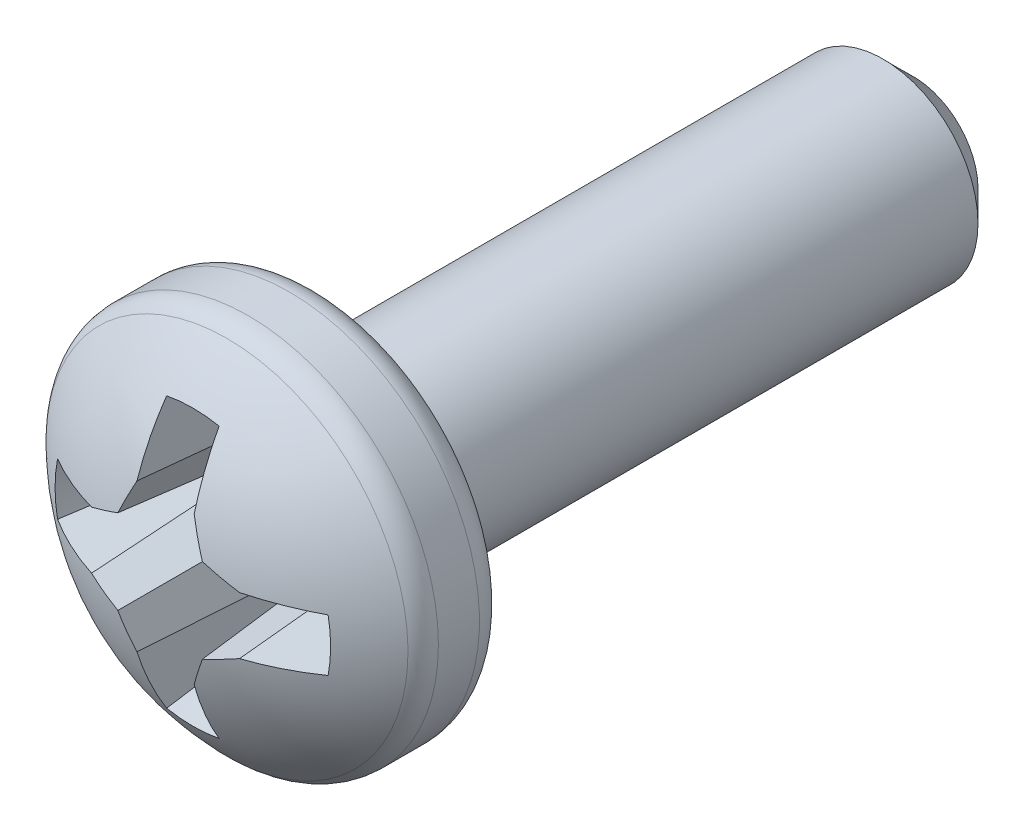
ISO-10303-21;
HEADER;
FILE_DESCRIPTION(('STEP AP214'),'2;1');
FILE_NAME('part.step','',(''),(''),'','','');
FILE_SCHEMA(('AUTOMOTIVE_DESIGN { 1 0 10303 214 1 1 1 1 }'));
ENDSEC;
DATA;
#1=APPLICATION_CONTEXT('core data for automotive mechanical design processes');
#2=APPLICATION_PROTOCOL_DEFINITION('international standard','automotive_design',2000,#1);
#3=PRODUCT_CONTEXT('',#1,'mechanical');
#4=PRODUCT('Part','Part','',(#3));
#5=PRODUCT_RELATED_PRODUCT_CATEGORY('part','',(#4));
#6=PRODUCT_DEFINITION_FORMATION('','',#4);
#7=PRODUCT_DEFINITION_CONTEXT('part definition',#1,'design');
#8=PRODUCT_DEFINITION('design','',#6,#7);
#9=PRODUCT_DEFINITION_SHAPE('','',#8);
#10=(LENGTH_UNIT() NAMED_UNIT(*) SI_UNIT(.MILLI.,.METRE.));
#11=(NAMED_UNIT(*) PLANE_ANGLE_UNIT() SI_UNIT($,.RADIAN.));
#12=(NAMED_UNIT(*) SI_UNIT($,.STERADIAN.) SOLID_ANGLE_UNIT());
#13=UNCERTAINTY_MEASURE_WITH_UNIT(LENGTH_MEASURE(1.E-05),#10,'distance_accuracy_value','');
#14=(GEOMETRIC_REPRESENTATION_CONTEXT(3) GLOBAL_UNCERTAINTY_ASSIGNED_CONTEXT((#13)) GLOBAL_UNIT_ASSIGNED_CONTEXT((#10,
#11,#12)) REPRESENTATION_CONTEXT('',''));
#15=CARTESIAN_POINT('',(0.,0.,0.));
#16=DIRECTION('',(0.,0.,1.));
#17=DIRECTION('',(1.,0.,0.));
#18=AXIS2_PLACEMENT_3D('',#15,#16,#17);
#19=CARTESIAN_POINT('',(-0.962921674615797,0.791461441644268,0.413196607862429));
#20=DIRECTION('',(0.,0.,1.));
#21=DIRECTION('',(1.,0.,0.));
#22=AXIS2_PLACEMENT_3D('',#19,#20,#21);
#23=PLANE('',#22);
#24=DIRECTION('',(0.382683432365081,-0.92387953251129,0.));
#25=VECTOR('',#24,1.);
#26=CARTESIAN_POINT('',(-0.949607787845929,0.796976234112247,0.413196607862429));
#27=LINE('',#26,#25);
#28=CARTESIAN_POINT('',(-0.957178033261302,0.815252423264536,0.413196607862429));
#29=VERTEX_POINT('',#28);
#30=CARTESIAN_POINT('',(-0.951892089679838,0.802491026580226,0.413196607862429));
#31=VERTEX_POINT('',#30);
#32=EDGE_CURVE('E292',#29,#31,#27,.T.);
#33=ORIENTED_EDGE('',*,*,#32,.F.);
#34=DIRECTION('',(0.,1.,0.));
#35=VECTOR('',#34,1.);
#36=CARTESIAN_POINT('',(-0.957178033261302,0.791461441644268,0.413196607862429));
#37=LINE('',#36,#35);
#38=CARTESIAN_POINT('',(-0.957178033261302,0.827667770288032,0.413196607862429));
#39=VERTEX_POINT('',#38);
#40=EDGE_CURVE('E168',#39,#29,#37,.F.);
#41=ORIENTED_EDGE('',*,*,#40,.F.);
#42=CARTESIAN_POINT('',(-0.962921674615797,0.791461441644268,0.413196607862429));
#43=DIRECTION('',(0.,0.,1.));
#44=DIRECTION('',(1.,0.,0.));
#45=AXIS2_PLACEMENT_3D('',#42,#43,#44);
#46=CIRCLE('',#45,0.0366590732270921);
#47=CARTESIAN_POINT('',(-0.968665315970288,0.827667770288033,0.413196607862429));
#48=VERTEX_POINT('',#47);
#49=EDGE_CURVE('E159',#39,#48,#46,.T.);
#50=ORIENTED_EDGE('',*,*,#49,.T.);
#51=DIRECTION('',(0.,1.,0.));
#52=VECTOR('',#51,1.);
#53=CARTESIAN_POINT('',(-0.968665315970287,0.791461441644271,0.413196607862429));
#54=LINE('',#53,#52);
#55=CARTESIAN_POINT('',(-0.968665315970288,0.815252423264539,0.413196607862429));
#56=VERTEX_POINT('',#55);
#57=EDGE_CURVE('E166',#56,#48,#54,.T.);
#58=ORIENTED_EDGE('',*,*,#57,.F.);
#59=DIRECTION('',(0.382683432365079,0.923879532511291,0.));
#60=VECTOR('',#59,1.);
#61=CARTESIAN_POINT('',(-0.976235561385661,0.79697623411225,0.413196607862429));
#62=LINE('',#61,#60);
#63=CARTESIAN_POINT('',(-0.973951259551752,0.802491026580229,0.413196607862429));
#64=VERTEX_POINT('',#63);
#65=EDGE_CURVE('E301',#64,#56,#62,.T.);
#66=ORIENTED_EDGE('',*,*,#65,.F.);
#67=DIRECTION('',(0.923879532511289,0.382683432365086,0.));
#68=VECTOR('',#67,1.);
#69=CARTESIAN_POINT('',(-0.968436467083772,0.804775328414139,0.413196607862429));
#70=LINE('',#69,#68);
#71=CARTESIAN_POINT('',(-0.986712656236062,0.797205082998765,0.413196607862429));
#72=VERTEX_POINT('',#71);
#73=EDGE_CURVE('E307',#72,#64,#70,.T.);
#74=ORIENTED_EDGE('',*,*,#73,.F.);
#75=DIRECTION('',(1.,0.,0.));
#76=VECTOR('',#75,1.);
#77=CARTESIAN_POINT('',(-0.962921674615793,0.797205082998765,0.413196607862429));
#78=LINE('',#77,#76);
#79=CARTESIAN_POINT('',(-0.999128003323473,0.797205082997996,0.413196607853642));
#80=VERTEX_POINT('',#79);
#81=EDGE_CURVE('E313',#80,#72,#78,.T.);
#82=ORIENTED_EDGE('',*,*,#81,.F.);
#83=CARTESIAN_POINT('',(-0.962921674615794,0.791461441644271,0.413196607862429));
#84=DIRECTION('',(0.,0.,1.));
#85=DIRECTION('',(1.,0.,0.));
#86=AXIS2_PLACEMENT_3D('',#83,#84,#85);
#87=CIRCLE('',#86,0.0366590732924525);
#88=CARTESIAN_POINT('',(-0.999128003325736,0.78571780028978,0.413196607862429));
#89=VERTEX_POINT('',#88);
#90=EDGE_CURVE('E410',#80,#89,#87,.T.);
#91=ORIENTED_EDGE('',*,*,#90,.T.);
#92=DIRECTION('',(1.,0.,0.));
#93=VECTOR('',#92,1.);
#94=CARTESIAN_POINT('',(-0.962921674615797,0.78571780028978,0.413196607862429));
#95=LINE('',#94,#93);
#96=CARTESIAN_POINT('',(-0.986712656236065,0.78571780028978,0.413196607862429));
#97=VERTEX_POINT('',#96);
#98=EDGE_CURVE('E247',#97,#89,#95,.F.);
#99=ORIENTED_EDGE('',*,*,#98,.F.);
#100=DIRECTION('',(-0.923879532511292,0.382683432365076,0.));
#101=VECTOR('',#100,1.);
#102=CARTESIAN_POINT('',(-0.968436467083776,0.778147554874406,0.413196607862429));
#103=LINE('',#102,#101);
#104=CARTESIAN_POINT('',(-0.973951259551755,0.780431856708316,0.413196607862429));
#105=VERTEX_POINT('',#104);
#106=EDGE_CURVE('E248',#105,#97,#103,.T.);
#107=ORIENTED_EDGE('',*,*,#106,.F.);
#108=DIRECTION('',(-0.38268343236509,0.923879532511287,0.));
#109=VECTOR('',#108,1.);
#110=CARTESIAN_POINT('',(-0.976235561385665,0.785946649176296,0.413196607862429));
#111=LINE('',#110,#109);
#112=CARTESIAN_POINT('',(-0.96866531597029,0.767670460024005,0.413196607862429));
#113=VERTEX_POINT('',#112);
#114=EDGE_CURVE('E254',#113,#105,#111,.T.);
#115=ORIENTED_EDGE('',*,*,#114,.F.);
#116=DIRECTION('',(0.,1.,0.));
#117=VECTOR('',#116,1.);
#118=CARTESIAN_POINT('',(-0.968665315970291,0.791461441644275,0.413196607862429));
#119=LINE('',#118,#117);
#120=CARTESIAN_POINT('',(-0.96866531597029,0.755255113000512,0.413196607862429));
#121=VERTEX_POINT('',#120);
#122=EDGE_CURVE('E260',#121,#113,#119,.T.);
#123=ORIENTED_EDGE('',*,*,#122,.F.);
#124=CARTESIAN_POINT('',(-0.962921674615796,0.791461441644275,0.413196607862429));
#125=DIRECTION('',(0.,0.,1.));
#126=DIRECTION('',(1.,0.,0.));
#127=AXIS2_PLACEMENT_3D('',#124,#125,#126);
#128=CIRCLE('',#127,0.0366590732270904);
#129=CARTESIAN_POINT('',(-0.957178033261305,0.755255113000512,0.413196607862429));
#130=VERTEX_POINT('',#129);
#131=EDGE_CURVE('E336',#121,#130,#128,.T.);
#132=ORIENTED_EDGE('',*,*,#131,.T.);
#133=DIRECTION('',(0.,1.,0.));
#134=VECTOR('',#133,1.);
#135=CARTESIAN_POINT('',(-0.957178033261306,0.791461441644272,0.413196607862429));
#136=LINE('',#135,#134);
#137=CARTESIAN_POINT('',(-0.957178033261305,0.767670460024002,0.413196607862429));
#138=VERTEX_POINT('',#137);
#139=EDGE_CURVE('E266',#138,#130,#136,.F.);
#140=ORIENTED_EDGE('',*,*,#139,.F.);
#141=DIRECTION('',(-0.382683432365075,-0.923879532511293,0.));
#142=VECTOR('',#141,1.);
#143=CARTESIAN_POINT('',(-0.949607787845931,0.785946649176293,0.413196607862429));
#144=LINE('',#143,#142);
#145=CARTESIAN_POINT('',(-0.951892089679841,0.780431856708313,0.413196607862429));
#146=VERTEX_POINT('',#145);
#147=EDGE_CURVE('E267',#146,#138,#144,.T.);
#148=ORIENTED_EDGE('',*,*,#147,.F.);
#149=DIRECTION('',(-0.923879532511286,-0.382683432365092,0.));
#150=VECTOR('',#149,1.);
#151=CARTESIAN_POINT('',(-0.957406882147821,0.778147554874402,0.413196607862429));
#152=LINE('',#151,#150);
#153=CARTESIAN_POINT('',(-0.939130692995531,0.785717800289777,0.413196607862429));
#154=VERTEX_POINT('',#153);
#155=EDGE_CURVE('E273',#154,#146,#152,.T.);
#156=ORIENTED_EDGE('',*,*,#155,.F.);
#157=DIRECTION('',(1.,0.,0.));
#158=VECTOR('',#157,1.);
#159=CARTESIAN_POINT('',(-0.9629216746158,0.785717800289777,0.413196607862429));
#160=LINE('',#159,#158);
#161=CARTESIAN_POINT('',(-0.926715345972033,0.785717800289777,0.413196607862429));
#162=VERTEX_POINT('',#161);
#163=EDGE_CURVE('E279',#162,#154,#160,.F.);
#164=ORIENTED_EDGE('',*,*,#163,.F.);
#165=CARTESIAN_POINT('',(-0.962921674615797,0.791461441644268,0.413196607862429));
#166=DIRECTION('',(0.,0.,1.));
#167=DIRECTION('',(1.,0.,0.));
#168=AXIS2_PLACEMENT_3D('',#165,#166,#167);
#169=CIRCLE('',#168,0.0366590732270921);
#170=CARTESIAN_POINT('',(-0.926715345972033,0.797205082998762,0.413196607862429));
#171=VERTEX_POINT('',#170);
#172=EDGE_CURVE('E492',#162,#171,#169,.T.);
#173=ORIENTED_EDGE('',*,*,#172,.T.);
#174=DIRECTION('',(1.,0.,0.));
#175=VECTOR('',#174,1.);
#176=CARTESIAN_POINT('',(-0.962921674615797,0.797205082998762,0.413196607862429));
#177=LINE('',#176,#175);
#178=CARTESIAN_POINT('',(-0.939130692995528,0.797205082998762,0.413196607862429));
#179=VERTEX_POINT('',#178);
#180=EDGE_CURVE('E285',#179,#171,#177,.T.);
#181=ORIENTED_EDGE('',*,*,#180,.F.);
#182=DIRECTION('',(0.92387953251129,-0.382683432365083,0.));
#183=VECTOR('',#182,1.);
#184=CARTESIAN_POINT('',(-0.957406882147817,0.804775328414136,0.413196607862429));
#185=LINE('',#184,#183);
#186=EDGE_CURVE('E286',#31,#179,#185,.T.);
#187=ORIENTED_EDGE('',*,*,#186,.F.);
#188=EDGE_LOOP('',(#33,#41,#50,#58,#66,#74,#82,#91,#99,#107,#115,#123,#132,#140,#148,#156,#164,
#173,#181,#187));
#189=FACE_BOUND('',#188,.T.);
#190=ADVANCED_FACE('F17',(#189),#23,.T.);
#191=CARTESIAN_POINT('',(-0.962921674615793,0.801303961329311,0.460047001563216));
#192=DIRECTION('',(0.,-0.996194698091744,0.0871557427476727));
#193=DIRECTION('',(0.,-0.0871557427476727,-0.996194698091744));
#194=AXIS2_PLACEMENT_3D('',#191,#192,#193);
#195=PLANE('',#194);
#196=DIRECTION('',(0.0173337504938421,-0.0871426484044557,-0.996045029063884));
#197=VECTOR('',#196,1.);
#198=CARTESIAN_POINT('',(-0.987456056740421,0.8009424097128,0.455914447676356));
#199=LINE('',#198,#197);
#200=CARTESIAN_POINT('',(-0.987456056740421,0.8009424097128,0.455914447676356));
#201=VERTEX_POINT('',#200);
#202=EDGE_CURVE('E310',#201,#72,#199,.T.);
#203=ORIENTED_EDGE('',*,*,#202,.F.);
#204=CARTESIAN_POINT('',(-1.0077693076876,0.800151088875881,0.446869609122098));
#205=CARTESIAN_POINT('',(-1.00458094800443,0.800321424804083,0.448816557690383));
#206=CARTESIAN_POINT('',(-1.00129399725059,0.800472536171256,0.450543768520713));
#207=CARTESIAN_POINT('',(-0.994522913601554,0.800736309783544,0.453558714705462));
#208=CARTESIAN_POINT('',(-0.991038780706358,0.800848972028658,0.45484645005988));
#209=CARTESIAN_POINT('',(-0.987456056740485,0.800942409712743,0.455914447676344));
#210=B_SPLINE_CURVE_WITH_KNOTS('',3,(#204,#205,#206,#207,#208,#209),.UNSPECIFIED.,.F.,.F.,(4,2,
4),(0.,0.011148597867128,0.022297195734256),.UNSPECIFIED.);
#211=CARTESIAN_POINT('',(-1.00776930767702,0.800151088874494,0.446869609106245));
#212=VERTEX_POINT('',#211);
#213=EDGE_CURVE('E409',#212,#201,#210,.T.);
#214=ORIENTED_EDGE('',*,*,#213,.F.);
#215=CARTESIAN_POINT('',(-1.00776930766644,0.800151088873107,0.446869609090392));
#216=CARTESIAN_POINT('',(-1.00633283988868,0.79966000435443,0.441256487356838));
#217=CARTESIAN_POINT('',(-1.00489449731313,0.799168961608414,0.435643843086986));
#218=CARTESIAN_POINT('',(-1.00201406253148,0.798186959649785,0.424419509338453));
#219=CARTESIAN_POINT('',(-1.00057197032529,0.797696000437175,0.418807819859794));
#220=CARTESIAN_POINT('',(-0.999128003321212,0.797205082997228,0.41319660784486));
#221=B_SPLINE_CURVE_WITH_KNOTS('',3,(#215,#216,#217,#218,#219,#220),.UNSPECIFIED.,.F.,.F.,(4,2,
4),(0.,0.0174443558891331,0.0348887122017165),.UNSPECIFIED.);
#222=EDGE_CURVE('E318',#212,#80,#221,.T.);
#223=ORIENTED_EDGE('',*,*,#222,.T.);
#224=ORIENTED_EDGE('',*,*,#81,.T.);
#225=EDGE_LOOP('',(#203,#214,#223,#224));
#226=FACE_BOUND('',#225,.T.);
#227=ADVANCED_FACE('F427',(#226),#195,.T.);
#228=CARTESIAN_POINT('',(-0.970005039912152,0.808562198209984,0.460047001563216));
#229=DIRECTION('',(0.381227206369649,-0.920363891963225,0.0871557427476661));
#230=DIRECTION('',(0.923879532511289,0.382683432365086,0.));
#231=AXIS2_PLACEMENT_3D('',#228,#229,#230);
#232=PLANE('',#231);
#233=DIRECTION('',(0.0666626913468222,-0.0666626913468392,-0.995546167269401));
#234=VECTOR('',#233,1.);
#235=CARTESIAN_POINT('',(-0.976933038303313,0.805472805331791,0.457726739301586));
#236=LINE('',#235,#234);
#237=CARTESIAN_POINT('',(-0.976933038303313,0.805472805331791,0.457726739301586));
#238=VERTEX_POINT('',#237);
#239=EDGE_CURVE('E304',#238,#64,#236,.T.);
#240=ORIENTED_EDGE('',*,*,#239,.F.);
#241=CARTESIAN_POINT('',(-0.987456056740421,0.8009424097128,0.455914447676356));
#242=CARTESIAN_POINT('',(-0.985725687185486,0.801700049456703,0.456346321822599));
#243=CARTESIAN_POINT('',(-0.983983584204926,0.802456402296903,0.456713283197823));
#244=CARTESIAN_POINT('',(-0.980475911392557,0.8039665341699,0.457317380406233));
#245=CARTESIAN_POINT('',(-0.978710341560748,0.804720313202697,0.457554516239419));
#246=CARTESIAN_POINT('',(-0.976933038303313,0.805472805331791,0.457726739301586));
#247=B_SPLINE_CURVE_WITH_KNOTS('',3,(#241,#242,#243,#244,#245,#246),.UNSPECIFIED.,.F.,.F.,(4,2,
4),(0.,0.00580300590917728,0.0116060118183544),.UNSPECIFIED.);
#248=EDGE_CURVE('E439',#201,#238,#247,.T.);
#249=ORIENTED_EDGE('',*,*,#248,.F.);
#250=ORIENTED_EDGE('',*,*,#202,.T.);
#251=ORIENTED_EDGE('',*,*,#73,.T.);
#252=EDGE_LOOP('',(#240,#249,#250,#251));
#253=FACE_BOUND('',#252,.T.);
#254=ADVANCED_FACE('F431',(#253),#232,.T.);
#255=CARTESIAN_POINT('',(-0.980022431181506,0.79854480694063,0.460047001563216));
#256=DIRECTION('',(0.920363891963229,-0.381227206369643,0.0871557427476506));
#257=DIRECTION('',(0.382683432365079,0.923879532511291,0.));
#258=AXIS2_PLACEMENT_3D('',#255,#256,#257);
#259=PLANE('',#258);
#260=DIRECTION('',(0.0871426484044276,-0.0173337504938855,-0.996045029063886));
#261=VECTOR('',#260,1.);
#262=CARTESIAN_POINT('',(-0.972402642684322,0.8159958237689,0.455914447676355));
#263=LINE('',#262,#261);
#264=CARTESIAN_POINT('',(-0.972402642684322,0.8159958237689,0.455914447676355));
#265=VERTEX_POINT('',#264);
#266=EDGE_CURVE('E176',#265,#56,#263,.T.);
#267=ORIENTED_EDGE('',*,*,#266,.F.);
#268=CARTESIAN_POINT('',(-0.976933038303313,0.805472805331791,0.457726739301586));
#269=CARTESIAN_POINT('',(-0.976180546174218,0.807250108589226,0.457554516239419));
#270=CARTESIAN_POINT('',(-0.975426767141422,0.809015678421036,0.457317380406232));
#271=CARTESIAN_POINT('',(-0.973916635268425,0.812523351233405,0.456713283197822));
#272=CARTESIAN_POINT('',(-0.973160282428224,0.814265454213965,0.456346321822598));
#273=CARTESIAN_POINT('',(-0.972402642684322,0.8159958237689,0.455914447676355));
#274=B_SPLINE_CURVE_WITH_KNOTS('',3,(#268,#269,#270,#271,#272,#273),.UNSPECIFIED.,.F.,.F.,(4,2,
4),(0.,0.00580300590917786,0.0116060118183556),.UNSPECIFIED.);
#275=EDGE_CURVE('E445',#238,#265,#274,.T.);
#276=ORIENTED_EDGE('',*,*,#275,.F.);
#277=ORIENTED_EDGE('',*,*,#239,.T.);
#278=ORIENTED_EDGE('',*,*,#65,.T.);
#279=EDGE_LOOP('',(#267,#276,#277,#278));
#280=FACE_BOUND('',#279,.T.);
#281=ADVANCED_FACE('F436',(#280),#259,.T.);
#282=CARTESIAN_POINT('',(-0.972764194300832,0.791461441644271,0.460047001563216));
#283=DIRECTION('',(0.996194698091747,0.,0.0871557427476441));
#284=DIRECTION('',(0.0871557427476441,0.,-0.996194698091747));
#285=AXIS2_PLACEMENT_3D('',#282,#283,#284);
#286=PLANE('',#285);
#287=CARTESIAN_POINT('',(-0.968665315976766,0.827667770297469,0.413196607882989));
#288=CARTESIAN_POINT('',(-0.969156233414293,0.829111737306517,0.41880781989701));
#289=CARTESIAN_POINT('',(-0.969647192625244,0.83055382951834,0.424419509374523));
#290=CARTESIAN_POINT('',(-0.970629194582071,0.833434264312577,0.435643843120299));
#291=CARTESIAN_POINT('',(-0.971120237327945,0.834872606895081,0.44125648738854));
#292=CARTESIAN_POINT('',(-0.971611321847241,0.836309074680451,0.446869609120248));
#293=B_SPLINE_CURVE_WITH_KNOTS('',3,(#287,#288,#289,#290,#291,#292),.UNSPECIFIED.,.F.,.F.,(4,2,
4),(0.,0.0174443563130369,0.0348887122026249),.UNSPECIFIED.);
#294=CARTESIAN_POINT('',(-0.971611321846646,0.836309074678713,0.446869609113457));
#295=VERTEX_POINT('',#294);
#296=EDGE_CURVE('E170',#48,#295,#293,.T.);
#297=ORIENTED_EDGE('',*,*,#296,.T.);
#298=CARTESIAN_POINT('',(-0.972402642684322,0.8159958237689,0.455914447676355));
#299=CARTESIAN_POINT('',(-0.97230920500029,0.819578547731674,0.454846450060827));
#300=CARTESIAN_POINT('',(-0.97219654275527,0.823062680623964,0.453558714707706));
#301=CARTESIAN_POINT('',(-0.971932769143257,0.829833764267578,0.450543768526282));
#302=CARTESIAN_POINT('',(-0.971781657776262,0.833120715018901,0.448816557697978));
#303=CARTESIAN_POINT('',(-0.971611321848281,0.83630907469974,0.446869609132083));
#304=B_SPLINE_CURVE_WITH_KNOTS('',3,(#298,#299,#300,#301,#302,#303),.UNSPECIFIED.,.F.,.F.,(4,2,
4),(0.,0.0111485978575969,0.0222971957151939),.UNSPECIFIED.);
#305=EDGE_CURVE('E450',#265,#295,#304,.T.);
#306=ORIENTED_EDGE('',*,*,#305,.F.);
#307=ORIENTED_EDGE('',*,*,#266,.T.);
#308=ORIENTED_EDGE('',*,*,#57,.T.);
#309=EDGE_LOOP('',(#297,#306,#307,#308));
#310=FACE_BOUND('',#309,.T.);
#311=ADVANCED_FACE('F173',(#310),#286,.T.);
#312=CARTESIAN_POINT('',(-0.962921674615797,0.791461441644268,0.446869608992984));
#313=DIRECTION('',(0.,0.,1.));
#314=DIRECTION('',(1.,0.,0.));
#315=AXIS2_PLACEMENT_3D('',#312,#313,#314);
#316=CONICAL_SURFACE('',#315,0.0456817267059768,0.261799388331704);
#317=ORIENTED_EDGE('',*,*,#296,.F.);
#318=ORIENTED_EDGE('',*,*,#49,.F.);
#319=CARTESIAN_POINT('',(-0.954232027377315,0.83630907468785,0.446869609127832));
#320=CARTESIAN_POINT('',(-0.954723111899205,0.834872606899889,0.441256487393958));
#321=CARTESIAN_POINT('',(-0.955214154647399,0.833434264314992,0.435643843123478));
#322=CARTESIAN_POINT('',(-0.956196156608315,0.830553829516367,0.424419509373073));
#323=CARTESIAN_POINT('',(-0.956687115821034,0.829111737302548,0.418807819893171));
#324=CARTESIAN_POINT('',(-0.957178033260055,0.827667770291702,0.413196607876686));
#325=B_SPLINE_CURVE_WITH_KNOTS('',3,(#319,#320,#321,#322,#323,#324),.UNSPECIFIED.,.F.,.F.,(4,2,
4),(0.,0.017444355898436,0.0348887122203239),.UNSPECIFIED.);
#326=CARTESIAN_POINT('',(-0.954232027383437,0.836309074691625,0.446869609130668));
#327=VERTEX_POINT('',#326);
#328=EDGE_CURVE('E182',#327,#39,#325,.T.);
#329=ORIENTED_EDGE('',*,*,#328,.F.);
#330=CARTESIAN_POINT('',(-0.962921674615797,0.791461441644268,0.44686960910667));
#331=DIRECTION('',(0.,0.,1.));
#332=DIRECTION('',(1.,0.,0.));
#333=AXIS2_PLACEMENT_3D('',#330,#331,#332);
#334=CIRCLE('',#333,0.045681726736439);
#335=EDGE_CURVE('E180',#295,#327,#334,.F.);
#336=ORIENTED_EDGE('',*,*,#335,.F.);
#337=EDGE_LOOP('',(#317,#318,#329,#336));
#338=FACE_BOUND('',#337,.T.);
#339=ADVANCED_FACE('F178',(#338),#316,.F.);
#340=CARTESIAN_POINT('',(-0.953079154930757,0.791461441644268,0.460047001563216));
#341=DIRECTION('',(-0.996194698091746,0.,0.0871557427476584));
#342=DIRECTION('',(0.0871557427476584,0.,0.996194698091746));
#343=AXIS2_PLACEMENT_3D('',#340,#341,#342);
#344=PLANE('',#343);
#345=DIRECTION('',(-0.0871426484044405,-0.0173337504938649,-0.996045029063885));
#346=VECTOR('',#345,1.);
#347=CARTESIAN_POINT('',(-0.953440706547268,0.815995823768896,0.455914447676356));
#348=LINE('',#347,#346);
#349=CARTESIAN_POINT('',(-0.953440706547268,0.815995823768896,0.455914447676356));
#350=VERTEX_POINT('',#349);
#351=EDGE_CURVE('E295',#350,#29,#348,.T.);
#352=ORIENTED_EDGE('',*,*,#351,.F.);
#353=CARTESIAN_POINT('',(-0.954232027383349,0.836309074700393,0.446869609131684));
#354=CARTESIAN_POINT('',(-0.954061691455357,0.833120715019461,0.448816557697674));
#355=CARTESIAN_POINT('',(-0.953910580088354,0.829833764268039,0.450543768526058));
#356=CARTESIAN_POINT('',(-0.953646806476326,0.823062680624212,0.453558714707614));
#357=CARTESIAN_POINT('',(-0.9535341442313,0.819578547731807,0.454846450060785));
#358=CARTESIAN_POINT('',(-0.953440706547262,0.81599582376891,0.45591444767635));
#359=B_SPLINE_CURVE_WITH_KNOTS('',3,(#353,#354,#355,#356,#357,#358),.UNSPECIFIED.,.F.,.F.,(4,2,
4),(0.,0.0111485978579733,0.0222971957159465),.UNSPECIFIED.);
#360=EDGE_CURVE('E210',#327,#350,#359,.T.);
#361=ORIENTED_EDGE('',*,*,#360,.F.);
#362=ORIENTED_EDGE('',*,*,#328,.T.);
#363=ORIENTED_EDGE('',*,*,#40,.T.);
#364=EDGE_LOOP('',(#352,#361,#362,#363));
#365=FACE_BOUND('',#364,.T.);
#366=ADVANCED_FACE('F199',(#365),#344,.T.);
#367=CARTESIAN_POINT('',(-0.945820918050084,0.798544806940627,0.460047001563216));
#368=DIRECTION('',(-0.920363891963228,-0.381227206369645,0.0871557427476584));
#369=DIRECTION('',(0.382683432365081,-0.92387953251129,0.));
#370=AXIS2_PLACEMENT_3D('',#367,#368,#369);
#371=PLANE('',#370);
#372=DIRECTION('',(-0.0666626913468367,-0.0666626913468319,-0.995546167269401));
#373=VECTOR('',#372,1.);
#374=CARTESIAN_POINT('',(-0.948910310928276,0.805472805331788,0.457726739301586));
#375=LINE('',#374,#373);
#376=CARTESIAN_POINT('',(-0.948910310928276,0.805472805331788,0.457726739301586));
#377=VERTEX_POINT('',#376);
#378=EDGE_CURVE('E289',#377,#31,#375,.T.);
#379=ORIENTED_EDGE('',*,*,#378,.F.);
#380=CARTESIAN_POINT('',(-0.953440706547268,0.815995823768896,0.455914447676356));
#381=CARTESIAN_POINT('',(-0.952683066803365,0.814265454213961,0.456346321822599));
#382=CARTESIAN_POINT('',(-0.951926713963165,0.812523351233401,0.456713283197823));
#383=CARTESIAN_POINT('',(-0.950416582090168,0.809015678421032,0.457317380406233));
#384=CARTESIAN_POINT('',(-0.949662803057371,0.807250108589222,0.457554516239419));
#385=CARTESIAN_POINT('',(-0.948910310928277,0.805472805331788,0.457726739301586));
#386=B_SPLINE_CURVE_WITH_KNOTS('',3,(#380,#381,#382,#383,#384,#385),.UNSPECIFIED.,.F.,.F.,(4,2,
4),(0.,0.00580300590917724,0.0116060118183544),.UNSPECIFIED.);
#387=EDGE_CURVE('E218',#350,#377,#386,.T.);
#388=ORIENTED_EDGE('',*,*,#387,.F.);
#389=ORIENTED_EDGE('',*,*,#351,.T.);
#390=ORIENTED_EDGE('',*,*,#32,.T.);
#391=EDGE_LOOP('',(#379,#388,#389,#390));
#392=FACE_BOUND('',#391,.T.);
#393=ADVANCED_FACE('F204',(#392),#371,.T.);
#394=CARTESIAN_POINT('',(-0.955838309319437,0.808562198209981,0.460047001563216));
#395=DIRECTION('',(-0.381227206369647,-0.920363891963227,0.0871557427476583));
#396=DIRECTION('',(0.92387953251129,-0.382683432365083,0.));
#397=AXIS2_PLACEMENT_3D('',#394,#395,#396);
#398=PLANE('',#397);
#399=DIRECTION('',(-0.0173337504938598,-0.0871426484044405,-0.996045029063885));
#400=VECTOR('',#399,1.);
#401=CARTESIAN_POINT('',(-0.938387292491168,0.800942409712797,0.455914447676356));
#402=LINE('',#401,#400);
#403=CARTESIAN_POINT('',(-0.938387292491168,0.800942409712797,0.455914447676356));
#404=VERTEX_POINT('',#403);
#405=EDGE_CURVE('E282',#404,#179,#402,.T.);
#406=ORIENTED_EDGE('',*,*,#405,.F.);
#407=CARTESIAN_POINT('',(-0.948910310928276,0.805472805331788,0.457726739301586));
#408=CARTESIAN_POINT('',(-0.947133007670842,0.804720313202693,0.457554516239419));
#409=CARTESIAN_POINT('',(-0.945367437839032,0.803966534169897,0.457317380406232));
#410=CARTESIAN_POINT('',(-0.941859765026662,0.8024564022969,0.456713283197822));
#411=CARTESIAN_POINT('',(-0.940117662046103,0.8017000494567,0.456346321822598));
#412=CARTESIAN_POINT('',(-0.938387292491168,0.800942409712797,0.455914447676355));
#413=B_SPLINE_CURVE_WITH_KNOTS('',3,(#407,#408,#409,#410,#411,#412),.UNSPECIFIED.,.F.,.F.,(4,2,
4),(0.,0.00580300590917751,0.0116060118183548),.UNSPECIFIED.);
#414=EDGE_CURVE('E462',#377,#404,#413,.T.);
#415=ORIENTED_EDGE('',*,*,#414,.F.);
#416=ORIENTED_EDGE('',*,*,#378,.T.);
#417=ORIENTED_EDGE('',*,*,#186,.T.);
#418=EDGE_LOOP('',(#406,#415,#416,#417));
#419=FACE_BOUND('',#418,.T.);
#420=ADVANCED_FACE('F474',(#419),#398,.T.);
#421=CARTESIAN_POINT('',(-0.962921674615797,0.801303961329307,0.460047001563216));
#422=DIRECTION('',(0.,-0.996194698091746,0.0871557427476584));
#423=DIRECTION('',(0.,-0.0871557427476584,-0.996194698091746));
#424=AXIS2_PLACEMENT_3D('',#421,#422,#423);
#425=PLANE('',#424);
#426=CARTESIAN_POINT('',(-0.926715345966802,0.79720508300054,0.41319660788275));
#427=CARTESIAN_POINT('',(-0.925271378955789,0.79769600044037,0.418807819896354));
#428=CARTESIAN_POINT('',(-0.923829286742633,0.798186959652864,0.424419509373678));
#429=CARTESIAN_POINT('',(-0.920948851946995,0.799168961611258,0.435643843119533));
#430=CARTESIAN_POINT('',(-0.919510509364422,0.799660004357156,0.441256487388042));
#431=CARTESIAN_POINT('',(-0.918074041579615,0.800151088875715,0.446869609120248));
#432=B_SPLINE_CURVE_WITH_KNOTS('',3,(#426,#427,#428,#429,#430,#431),.UNSPECIFIED.,.F.,.F.,(4,2,
4),(0.,0.0174443563138727,0.0348887122042951),.UNSPECIFIED.);
#433=CARTESIAN_POINT('',(-0.918074041581353,0.800151088875121,0.446869609113457));
#434=VERTEX_POINT('',#433);
#435=EDGE_CURVE('E351',#171,#434,#432,.T.);
#436=ORIENTED_EDGE('',*,*,#435,.T.);
#437=CARTESIAN_POINT('',(-0.938387292491168,0.800942409712797,0.455914447676355));
#438=CARTESIAN_POINT('',(-0.934804568528381,0.800848972028783,0.454846450060821));
#439=CARTESIAN_POINT('',(-0.931320435636079,0.800736309783763,0.453558714707696));
#440=CARTESIAN_POINT('',(-0.924549351992442,0.80047253617171,0.450543768526262));
#441=CARTESIAN_POINT('',(-0.921262401241108,0.800321424804677,0.448816557697955));
#442=CARTESIAN_POINT('',(-0.918074041560258,0.800151088876637,0.446869609132056));
#443=B_SPLINE_CURVE_WITH_KNOTS('',3,(#437,#438,#439,#440,#441,#442),.UNSPECIFIED.,.F.,.F.,(4,2,
4),(0.,0.0111485978576364,0.0222971957152729),.UNSPECIFIED.);
#444=EDGE_CURVE('E463',#404,#434,#443,.T.);
#445=ORIENTED_EDGE('',*,*,#444,.F.);
#446=ORIENTED_EDGE('',*,*,#405,.T.);
#447=ORIENTED_EDGE('',*,*,#180,.T.);
#448=EDGE_LOOP('',(#436,#445,#446,#447));
#449=FACE_BOUND('',#448,.T.);
#450=ADVANCED_FACE('F477',(#449),#425,.T.);
#451=CARTESIAN_POINT('',(-0.962921674615797,0.791461441644268,0.446869608992984));
#452=DIRECTION('',(0.,0.,1.));
#453=DIRECTION('',(1.,0.,0.));
#454=AXIS2_PLACEMENT_3D('',#451,#452,#453);
#455=CONICAL_SURFACE('',#454,0.0456817267059768,0.261799388331704);
#456=ORIENTED_EDGE('',*,*,#172,.F.);
#457=CARTESIAN_POINT('',(-0.918074041572215,0.78277179440579,0.446869609127831));
#458=CARTESIAN_POINT('',(-0.919510509360244,0.783262878927704,0.44125648739369));
#459=CARTESIAN_POINT('',(-0.92094885194521,0.783753921675921,0.435643843122941));
#460=CARTESIAN_POINT('',(-0.923829286743973,0.784735923636883,0.424419509372));
#461=CARTESIAN_POINT('',(-0.925271378957862,0.785226882849626,0.41880781989183));
#462=CARTESIAN_POINT('',(-0.926715345968777,0.785717800288671,0.413196607875076));
#463=B_SPLINE_CURVE_WITH_KNOTS('',3,(#457,#458,#459,#460,#461,#462),.UNSPECIFIED.,.F.,.F.,(4,2,
4),(0.,0.0174443558992698,0.0348887122219916),.UNSPECIFIED.);
#464=CARTESIAN_POINT('',(-0.918074041568439,0.782771794411913,0.446869609130668));
#465=VERTEX_POINT('',#464);
#466=EDGE_CURVE('E346',#465,#162,#463,.T.);
#467=ORIENTED_EDGE('',*,*,#466,.F.);
#468=CARTESIAN_POINT('',(-0.962921674615797,0.791461441644268,0.44686960910667));
#469=DIRECTION('',(0.,0.,1.));
#470=DIRECTION('',(1.,0.,0.));
#471=AXIS2_PLACEMENT_3D('',#468,#469,#470);
#472=CIRCLE('',#471,0.045681726736439);
#473=EDGE_CURVE('E464',#434,#465,#472,.F.);
#474=ORIENTED_EDGE('',*,*,#473,.F.);
#475=ORIENTED_EDGE('',*,*,#435,.F.);
#476=EDGE_LOOP('',(#456,#467,#474,#475));
#477=FACE_BOUND('',#476,.T.);
#478=ADVANCED_FACE('F482',(#477),#455,.F.);
#479=CARTESIAN_POINT('',(-0.9629216746158,0.781618921959232,0.460047001563216));
#480=DIRECTION('',(0.,0.996194698091747,0.0871557427476441));
#481=DIRECTION('',(0.,-0.0871557427476441,0.996194698091747));
#482=AXIS2_PLACEMENT_3D('',#479,#480,#481);
#483=PLANE('',#482);
#484=DIRECTION('',(-0.0173337504938417,0.0871426484044261,-0.996045029063887));
#485=VECTOR('',#484,1.);
#486=CARTESIAN_POINT('',(-0.938387292491172,0.781980473575742,0.455914447676357));
#487=LINE('',#486,#485);
#488=CARTESIAN_POINT('',(-0.938387292491172,0.781980473575742,0.455914447676357));
#489=VERTEX_POINT('',#488);
#490=EDGE_CURVE('E276',#489,#154,#487,.T.);
#491=ORIENTED_EDGE('',*,*,#490,.F.);
#492=CARTESIAN_POINT('',(-0.918074041559671,0.782771794411824,0.446869609131684));
#493=CARTESIAN_POINT('',(-0.921262401240596,0.782601458483823,0.448816557697669));
#494=CARTESIAN_POINT('',(-0.924549351992011,0.78245034711682,0.45054376852605));
#495=CARTESIAN_POINT('',(-0.931320435635823,0.782186573504812,0.453558714707603));
#496=CARTESIAN_POINT('',(-0.93480456852822,0.782073911259807,0.454846450060776));
#497=CARTESIAN_POINT('',(-0.938387292491108,0.7819804735758,0.455914447676344));
#498=B_SPLINE_CURVE_WITH_KNOTS('',3,(#492,#493,#494,#495,#496,#497),.UNSPECIFIED.,.F.,.F.,(4,2,
4),(0.,0.0111485978579499,0.0222971957159),.UNSPECIFIED.);
#499=EDGE_CURVE('E509',#465,#489,#498,.T.);
#500=ORIENTED_EDGE('',*,*,#499,.F.);
#501=ORIENTED_EDGE('',*,*,#466,.T.);
#502=ORIENTED_EDGE('',*,*,#163,.T.);
#503=EDGE_LOOP('',(#491,#500,#501,#502));
#504=FACE_BOUND('',#503,.T.);
#505=ADVANCED_FACE('F499',(#504),#483,.T.);
#506=CARTESIAN_POINT('',(-0.955838309319441,0.774360685078558,0.460047001563216));
#507=DIRECTION('',(-0.381227206369656,0.920363891963225,0.0871557427476397));
#508=DIRECTION('',(-0.923879532511286,-0.382683432365092,0.));
#509=AXIS2_PLACEMENT_3D('',#506,#507,#508);
#510=PLANE('',#509);
#511=DIRECTION('',(-0.066662691346817,0.0666626913468194,-0.995546167269403));
#512=VECTOR('',#511,1.);
#513=CARTESIAN_POINT('',(-0.94891031092828,0.777450077956752,0.457726739301588));
#514=LINE('',#513,#512);
#515=CARTESIAN_POINT('',(-0.94891031092828,0.777450077956752,0.457726739301588));
#516=VERTEX_POINT('',#515);
#517=EDGE_CURVE('E270',#516,#146,#514,.T.);
#518=ORIENTED_EDGE('',*,*,#517,.F.);
#519=CARTESIAN_POINT('',(-0.938387292491172,0.781980473575742,0.455914447676357));
#520=CARTESIAN_POINT('',(-0.940117662046106,0.781222833831839,0.4563463218226));
#521=CARTESIAN_POINT('',(-0.941859765026666,0.780466480991639,0.456713283197824));
#522=CARTESIAN_POINT('',(-0.945367437839035,0.778956349118642,0.457317380406234));
#523=CARTESIAN_POINT('',(-0.947133007670845,0.778202570085846,0.45755451623942));
#524=CARTESIAN_POINT('',(-0.94891031092828,0.777450077956751,0.457726739301587));
#525=B_SPLINE_CURVE_WITH_KNOTS('',3,(#519,#520,#521,#522,#523,#524),.UNSPECIFIED.,.F.,.F.,(4,2,
4),(0.,0.0058030059091771,0.0116060118183543),.UNSPECIFIED.);
#526=EDGE_CURVE('E515',#489,#516,#525,.T.);
#527=ORIENTED_EDGE('',*,*,#526,.F.);
#528=ORIENTED_EDGE('',*,*,#490,.T.);
#529=ORIENTED_EDGE('',*,*,#155,.T.);
#530=EDGE_LOOP('',(#518,#527,#528,#529));
#531=FACE_BOUND('',#530,.T.);
#532=ADVANCED_FACE('F503',(#531),#510,.T.);
#533=CARTESIAN_POINT('',(-0.945820918050087,0.784378076347913,0.460047001563216));
#534=DIRECTION('',(-0.920363891963232,0.381227206369639,0.0871557427476397));
#535=DIRECTION('',(-0.382683432365075,-0.923879532511293,0.));
#536=AXIS2_PLACEMENT_3D('',#533,#534,#535);
#537=PLANE('',#536);
#538=DIRECTION('',(-0.0871426484044261,0.0173337504938367,-0.996045029063887));
#539=VECTOR('',#538,1.);
#540=CARTESIAN_POINT('',(-0.953440706547271,0.766927059519643,0.455914447676357));
#541=LINE('',#540,#539);
#542=CARTESIAN_POINT('',(-0.953440706547271,0.766927059519643,0.455914447676357));
#543=VERTEX_POINT('',#542);
#544=EDGE_CURVE('E263',#543,#138,#541,.T.);
#545=ORIENTED_EDGE('',*,*,#544,.F.);
#546=CARTESIAN_POINT('',(-0.94891031092828,0.777450077956752,0.457726739301587));
#547=CARTESIAN_POINT('',(-0.949662803057374,0.775672774699317,0.45755451623942));
#548=CARTESIAN_POINT('',(-0.950416582090171,0.773907204867507,0.457317380406234));
#549=CARTESIAN_POINT('',(-0.951926713963168,0.770399532055138,0.456713283197824));
#550=CARTESIAN_POINT('',(-0.952683066803368,0.768657429074578,0.4563463218226));
#551=CARTESIAN_POINT('',(-0.953440706547271,0.766927059519643,0.455914447676357));
#552=B_SPLINE_CURVE_WITH_KNOTS('',3,(#546,#547,#548,#549,#550,#551),.UNSPECIFIED.,.F.,.F.,(4,2,
4),(0.,0.00580300590917769,0.0116060118183553),.UNSPECIFIED.);
#553=EDGE_CURVE('E535',#516,#543,#552,.T.);
#554=ORIENTED_EDGE('',*,*,#553,.F.);
#555=ORIENTED_EDGE('',*,*,#517,.T.);
#556=ORIENTED_EDGE('',*,*,#147,.T.);
#557=EDGE_LOOP('',(#545,#554,#555,#556));
#558=FACE_BOUND('',#557,.T.);
#559=ADVANCED_FACE('F548',(#558),#537,.T.);
#560=CARTESIAN_POINT('',(-0.953079154930761,0.791461441644272,0.460047001563216));
#561=DIRECTION('',(-0.996194698091747,0.,0.0871557427476441));
#562=DIRECTION('',(0.0871557427476441,0.,0.996194698091747));
#563=AXIS2_PLACEMENT_3D('',#560,#561,#562);
#564=PLANE('',#563);
#565=CARTESIAN_POINT('',(-0.957178033254827,0.755255112991075,0.413196607882989));
#566=CARTESIAN_POINT('',(-0.956687115817305,0.7538111459817,0.418807819896942));
#567=CARTESIAN_POINT('',(-0.956196156606361,0.752369053769549,0.424419509374387));
#568=CARTESIAN_POINT('',(-0.955214154649546,0.749488618974655,0.435643843120026));
#569=CARTESIAN_POINT('',(-0.954723111903678,0.748050276391821,0.441256487388198));
#570=CARTESIAN_POINT('',(-0.954232027384388,0.746613808606119,0.446869609119838));
#571=B_SPLINE_CURVE_WITH_KNOTS('',3,(#565,#566,#567,#568,#569,#570),.UNSPECIFIED.,.F.,.F.,(4,2,
4),(0.,0.0174443563130817,0.0348887122027145),.UNSPECIFIED.);
#572=CARTESIAN_POINT('',(-0.954232027384964,0.746613808607805,0.446869609113252));
#573=VERTEX_POINT('',#572);
#574=EDGE_CURVE('E559',#130,#573,#571,.T.);
#575=ORIENTED_EDGE('',*,*,#574,.T.);
#576=CARTESIAN_POINT('',(-0.953440706547271,0.766927059519643,0.455914447676357));
#577=CARTESIAN_POINT('',(-0.953534144231306,0.763344335556773,0.4548464500608));
#578=CARTESIAN_POINT('',(-0.953646806476329,0.759860202664392,0.45355871470764));
#579=CARTESIAN_POINT('',(-0.953910580088351,0.75308911902061,0.450543768526114));
#580=CARTESIAN_POINT('',(-0.954061691455351,0.749802168269209,0.448816557697747));
#581=CARTESIAN_POINT('',(-0.954232027383339,0.746613808588297,0.446869609131778));
#582=B_SPLINE_CURVE_WITH_KNOTS('',3,(#576,#577,#578,#579,#580,#581),.UNSPECIFIED.,.F.,.F.,(4,2,
4),(0.,0.0111485978578924,0.0222971957157848),.UNSPECIFIED.);
#583=EDGE_CURVE('E536',#543,#573,#582,.T.);
#584=ORIENTED_EDGE('',*,*,#583,.F.);
#585=ORIENTED_EDGE('',*,*,#544,.T.);
#586=ORIENTED_EDGE('',*,*,#139,.T.);
#587=EDGE_LOOP('',(#575,#584,#585,#586));
#588=FACE_BOUND('',#587,.T.);
#589=ADVANCED_FACE('F551',(#588),#564,.T.);
#590=CARTESIAN_POINT('',(-0.962921674615796,0.791461441644275,0.446869608879296));
#591=DIRECTION('',(0.,0.,1.));
#592=DIRECTION('',(1.,0.,0.));
#593=AXIS2_PLACEMENT_3D('',#590,#591,#592);
#594=CONICAL_SURFACE('',#593,0.0456817266775537,0.261799388388261);
#595=ORIENTED_EDGE('',*,*,#131,.F.);
#596=CARTESIAN_POINT('',(-0.971611321853666,0.746613808599184,0.446869609127591));
#597=CARTESIAN_POINT('',(-0.97112023733207,0.748050276387244,0.441256487393702));
#598=CARTESIAN_POINT('',(-0.970629194584074,0.749488618972317,0.435643843123234));
#599=CARTESIAN_POINT('',(-0.969647192623362,0.752369053771445,0.424419509372909));
#600=CARTESIAN_POINT('',(-0.969156233410649,0.753811145985592,0.418807819893075));
#601=CARTESIAN_POINT('',(-0.968665315971538,0.755255112996842,0.413196607876686));
#602=B_SPLINE_CURVE_WITH_KNOTS('',3,(#596,#597,#598,#599,#600,#601),.UNSPECIFIED.,.F.,.F.,(4,2,
4),(0.,0.0174443558984814,0.0348887122204145),.UNSPECIFIED.);
#603=CARTESIAN_POINT('',(-0.971611321848124,0.746613808595678,0.446869609130311));
#604=VERTEX_POINT('',#603);
#605=EDGE_CURVE('E331',#604,#121,#602,.T.);
#606=ORIENTED_EDGE('',*,*,#605,.F.);
#607=CARTESIAN_POINT('',(-0.962921674615796,0.791461441644275,0.44686960910667));
#608=DIRECTION('',(0.,0.,1.));
#609=DIRECTION('',(1.,0.,0.));
#610=AXIS2_PLACEMENT_3D('',#607,#608,#609);
#611=CIRCLE('',#610,0.0456817267384783);
#612=EDGE_CURVE('E538',#573,#604,#611,.F.);
#613=ORIENTED_EDGE('',*,*,#612,.F.);
#614=ORIENTED_EDGE('',*,*,#574,.F.);
#615=EDGE_LOOP('',(#595,#606,#613,#614));
#616=FACE_BOUND('',#615,.T.);
#617=ADVANCED_FACE('F555',(#616),#594,.F.);
#618=CARTESIAN_POINT('',(-0.972764194300836,0.791461441644275,0.460047001563216));
#619=DIRECTION('',(0.996194698091746,0.,0.0871557427476584));
#620=DIRECTION('',(0.0871557427476584,0.,-0.996194698091746));
#621=AXIS2_PLACEMENT_3D('',#618,#619,#620);
#622=PLANE('',#621);
#623=DIRECTION('',(0.0871426484044388,0.0173337504938311,-0.996045029063886));
#624=VECTOR('',#623,1.);
#625=CARTESIAN_POINT('',(-0.972402642684325,0.766927059519646,0.455914447676358));
#626=LINE('',#625,#624);
#627=CARTESIAN_POINT('',(-0.972402642684325,0.766927059519647,0.455914447676358));
#628=VERTEX_POINT('',#627);
#629=EDGE_CURVE('E257',#628,#113,#626,.T.);
#630=ORIENTED_EDGE('',*,*,#629,.F.);
#631=CARTESIAN_POINT('',(-0.971611321848218,0.746613808587644,0.446869609131378));
#632=CARTESIAN_POINT('',(-0.971781657776215,0.749802168268647,0.448816557697443));
#633=CARTESIAN_POINT('',(-0.971932769143224,0.753089119020148,0.450543768525889));
#634=CARTESIAN_POINT('',(-0.972196542755261,0.759860202664144,0.453558714707547));
#635=CARTESIAN_POINT('',(-0.972309205000291,0.763344335556639,0.454846450060759));
#636=CARTESIAN_POINT('',(-0.972402642684331,0.766927059519632,0.455914447676352));
#637=B_SPLINE_CURVE_WITH_KNOTS('',3,(#631,#632,#633,#634,#635,#636),.UNSPECIFIED.,.F.,.F.,(4,2,
4),(0.,0.0111485978582691,0.0222971957165382),.UNSPECIFIED.);
#638=EDGE_CURVE('E574',#604,#628,#637,.T.);
#639=ORIENTED_EDGE('',*,*,#638,.F.);
#640=ORIENTED_EDGE('',*,*,#605,.T.);
#641=ORIENTED_EDGE('',*,*,#122,.T.);
#642=EDGE_LOOP('',(#630,#639,#640,#641));
#643=FACE_BOUND('',#642,.T.);
#644=ADVANCED_FACE('F582',(#643),#622,.T.);
#645=CARTESIAN_POINT('',(-0.980022431181509,0.784378076347916,0.460047001563216));
#646=DIRECTION('',(0.920363891963225,0.381227206369654,0.0871557427476474));
#647=DIRECTION('',(-0.38268343236509,0.923879532511287,0.));
#648=AXIS2_PLACEMENT_3D('',#645,#646,#647);
#649=PLANE('',#648);
#650=DIRECTION('',(0.0666626913468171,0.0666626913468098,-0.995546167269403));
#651=VECTOR('',#650,1.);
#652=CARTESIAN_POINT('',(-0.976933038303316,0.777450077956755,0.457726739301588));
#653=LINE('',#652,#651);
#654=CARTESIAN_POINT('',(-0.976933038303316,0.777450077956755,0.457726739301588));
#655=VERTEX_POINT('',#654);
#656=EDGE_CURVE('E251',#655,#105,#653,.T.);
#657=ORIENTED_EDGE('',*,*,#656,.F.);
#658=CARTESIAN_POINT('',(-0.972402642684325,0.766927059519647,0.455914447676357));
#659=CARTESIAN_POINT('',(-0.973160282428228,0.768657429074581,0.4563463218226));
#660=CARTESIAN_POINT('',(-0.973916635268428,0.770399532055141,0.456713283197824));
#661=CARTESIAN_POINT('',(-0.975426767141425,0.773907204867511,0.457317380406234));
#662=CARTESIAN_POINT('',(-0.976180546174221,0.77567277469932,0.45755451623942));
#663=CARTESIAN_POINT('',(-0.976933038303316,0.777450077956755,0.457726739301587));
#664=B_SPLINE_CURVE_WITH_KNOTS('',3,(#658,#659,#660,#661,#662,#663),.UNSPECIFIED.,.F.,.F.,(4,2,
4),(0.,0.00580300590917738,0.0116060118183549),.UNSPECIFIED.);
#665=EDGE_CURVE('E575',#628,#655,#664,.T.);
#666=ORIENTED_EDGE('',*,*,#665,.F.);
#667=ORIENTED_EDGE('',*,*,#629,.T.);
#668=ORIENTED_EDGE('',*,*,#114,.T.);
#669=EDGE_LOOP('',(#657,#666,#667,#668));
#670=FACE_BOUND('',#669,.T.);
#671=ADVANCED_FACE('F585',(#670),#649,.T.);
#672=CARTESIAN_POINT('',(-0.970005039912155,0.774360685078562,0.460047001563217));
#673=DIRECTION('',(0.381227206369641,0.920363891963232,0.0871557427476319));
#674=DIRECTION('',(-0.923879532511292,0.382683432365076,0.));
#675=AXIS2_PLACEMENT_3D('',#672,#673,#674);
#676=PLANE('',#675);
#677=DIRECTION('',(0.017333750493867,0.0871426484044134,-0.996045029063888));
#678=VECTOR('',#677,1.);
#679=CARTESIAN_POINT('',(-0.987456056740425,0.781980473575746,0.455914447676357));
#680=LINE('',#679,#678);
#681=CARTESIAN_POINT('',(-0.987456056740425,0.781980473575746,0.455914447676357));
#682=VERTEX_POINT('',#681);
#683=EDGE_CURVE('E244',#682,#97,#680,.T.);
#684=ORIENTED_EDGE('',*,*,#683,.F.);
#685=CARTESIAN_POINT('',(-0.976933038303316,0.777450077956755,0.457726739301587));
#686=CARTESIAN_POINT('',(-0.97871034156075,0.778202570085849,0.45755451623942));
#687=CARTESIAN_POINT('',(-0.98047591139256,0.778956349118646,0.457317380406234));
#688=CARTESIAN_POINT('',(-0.98398358420493,0.780466480991643,0.456713283197824));
#689=CARTESIAN_POINT('',(-0.98572568718549,0.781222833831843,0.456346321822599));
#690=CARTESIAN_POINT('',(-0.987456056740425,0.781980473575746,0.455914447676356));
#691=B_SPLINE_CURVE_WITH_KNOTS('',3,(#685,#686,#687,#688,#689,#690),.UNSPECIFIED.,.F.,.F.,(4,2,
4),(0.,0.00580300590917758,0.0116060118183557),.UNSPECIFIED.);
#692=EDGE_CURVE('E388',#655,#682,#691,.T.);
#693=ORIENTED_EDGE('',*,*,#692,.F.);
#694=ORIENTED_EDGE('',*,*,#656,.T.);
#695=ORIENTED_EDGE('',*,*,#106,.T.);
#696=EDGE_LOOP('',(#684,#693,#694,#695));
#697=FACE_BOUND('',#696,.T.);
#698=ADVANCED_FACE('F397',(#697),#676,.T.);
#699=CARTESIAN_POINT('',(-0.962921674615797,0.781618921959236,0.460047001563216));
#700=DIRECTION('',(0.,0.996194698091748,0.0871557427476297));
#701=DIRECTION('',(0.,-0.0871557427476297,0.996194698091748));
#702=AXIS2_PLACEMENT_3D('',#699,#700,#701);
#703=PLANE('',#702);
#704=CARTESIAN_POINT('',(-0.999128003318405,0.785717800294765,0.413196607846229));
#705=CARTESIAN_POINT('',(-1.00057197032391,0.785226882853084,0.418807819860586));
#706=CARTESIAN_POINT('',(-1.00201406253105,0.78473592363932,0.424419509338842));
#707=CARTESIAN_POINT('',(-1.00489449731364,0.783753921679543,0.43564384308692));
#708=CARTESIAN_POINT('',(-1.00633283988918,0.783262878933532,0.441256487356718));
#709=CARTESIAN_POINT('',(-1.00776930766645,0.782771794415439,0.446869609090392));
#710=B_SPLINE_CURVE_WITH_KNOTS('',3,(#704,#705,#706,#707,#708,#709),.UNSPECIFIED.,.F.,.F.,(4,2,
4),(0.,0.0174443563124176,0.0348887122013838),.UNSPECIFIED.);
#711=CARTESIAN_POINT('',(-1.00776930766125,0.782771794417214,0.446869609070109));
#712=VERTEX_POINT('',#711);
#713=EDGE_CURVE('E403',#89,#712,#710,.T.);
#714=ORIENTED_EDGE('',*,*,#713,.T.);
#715=CARTESIAN_POINT('',(-0.987456056740425,0.781980473575746,0.455914447676356));
#716=CARTESIAN_POINT('',(-0.991038780706319,0.782073911259841,0.454846450059891));
#717=CARTESIAN_POINT('',(-0.994522913601535,0.782186573504974,0.453558714705468));
#718=CARTESIAN_POINT('',(-1.00129399725061,0.782450347117318,0.450543768520709));
#719=CARTESIAN_POINT('',(-1.00458094800447,0.782601458484529,0.448816557690373));
#720=CARTESIAN_POINT('',(-1.00776930768765,0.782771794412779,0.44686960912208));
#721=B_SPLINE_CURVE_WITH_KNOTS('',3,(#715,#716,#717,#718,#719,#720),.UNSPECIFIED.,.F.,.F.,(4,2,
4),(0.,0.0111485978671895,0.0222971957343788),.UNSPECIFIED.);
#722=EDGE_CURVE('E382',#682,#712,#721,.T.);
#723=ORIENTED_EDGE('',*,*,#722,.F.);
#724=ORIENTED_EDGE('',*,*,#683,.T.);
#725=ORIENTED_EDGE('',*,*,#98,.T.);
#726=EDGE_LOOP('',(#714,#723,#724,#725));
#727=FACE_BOUND('',#726,.T.);
#728=ADVANCED_FACE('F394',(#727),#703,.T.);
#729=CARTESIAN_POINT('',(-0.962921674615793,0.791461441644271,0.446869608879295));
#730=DIRECTION('',(0.,0.,1.));
#731=DIRECTION('',(0.,-1.,0.));
#732=AXIS2_PLACEMENT_3D('',#729,#730,#731);
#733=CONICAL_SURFACE('',#732,0.0456817266972227,0.261799387122199);
#734=ORIENTED_EDGE('',*,*,#90,.F.);
#735=ORIENTED_EDGE('',*,*,#222,.F.);
#736=CARTESIAN_POINT('',(-0.962921674615793,0.791461441644271,0.446869609049826));
#737=DIRECTION('',(0.,0.,1.));
#738=DIRECTION('',(0.,-1.,0.));
#739=AXIS2_PLACEMENT_3D('',#736,#737,#738);
#740=CIRCLE('',#739,0.0456817267429161);
#741=EDGE_CURVE('E380',#712,#212,#740,.F.);
#742=ORIENTED_EDGE('',*,*,#741,.F.);
#743=ORIENTED_EDGE('',*,*,#713,.F.);
#744=EDGE_LOOP('',(#734,#735,#742,#743));
#745=FACE_BOUND('',#744,.T.);
#746=ADVANCED_FACE('F231',(#745),#733,.F.);
#747=CARTESIAN_POINT('',(-0.962921674615797,0.791461441644268,0.374276472879301));
#748=DIRECTION('',(1.,0.,0.));
#749=DIRECTION('',(0.,1.,0.));
#750=AXIS2_PLACEMENT_3D('',#747,#748,#749);
#751=SPHERICAL_SURFACE('',#750,0.0857705286839147);
#752=ORIENTED_EDGE('',*,*,#444,.T.);
#753=ORIENTED_EDGE('',*,*,#473,.T.);
#754=ORIENTED_EDGE('',*,*,#499,.T.);
#755=ORIENTED_EDGE('',*,*,#526,.T.);
#756=ORIENTED_EDGE('',*,*,#553,.T.);
#757=ORIENTED_EDGE('',*,*,#583,.T.);
#758=ORIENTED_EDGE('',*,*,#612,.T.);
#759=ORIENTED_EDGE('',*,*,#638,.T.);
#760=ORIENTED_EDGE('',*,*,#665,.T.);
#761=ORIENTED_EDGE('',*,*,#692,.T.);
#762=ORIENTED_EDGE('',*,*,#722,.T.);
#763=ORIENTED_EDGE('',*,*,#741,.T.);
#764=ORIENTED_EDGE('',*,*,#213,.T.);
#765=ORIENTED_EDGE('',*,*,#248,.T.);
#766=ORIENTED_EDGE('',*,*,#275,.T.);
#767=ORIENTED_EDGE('',*,*,#305,.T.);
#768=ORIENTED_EDGE('',*,*,#335,.T.);
#769=ORIENTED_EDGE('',*,*,#360,.T.);
#770=ORIENTED_EDGE('',*,*,#387,.T.);
#771=ORIENTED_EDGE('',*,*,#414,.T.);
#772=EDGE_LOOP('',(#752,#753,#754,#755,#756,#757,#758,#759,#760,#761,#762,#763,#764,#765,#766,
#767,#768,#769,#770,#771));
#773=FACE_BOUND('',#772,.T.);
#774=CARTESIAN_POINT('',(-0.962921674615797,0.791461441644267,0.435555053516584));
#775=DIRECTION('',(0.,0.,-1.));
#776=DIRECTION('',(0.,1.,0.));
#777=AXIS2_PLACEMENT_3D('',#774,#775,#776);
#778=CIRCLE('',#777,0.0600126582130676);
#779=CARTESIAN_POINT('',(-0.962921674615797,0.851474099857335,0.435555053516583));
#780=VERTEX_POINT('',#779);
#781=EDGE_CURVE('E376',#780,#780,#778,.T.);
#782=ORIENTED_EDGE('',*,*,#781,.F.);
#783=EDGE_LOOP('',(#782));
#784=FACE_BOUND('',#783,.T.);
#785=ADVANCED_FACE('F224',(#773,#784),#751,.T.);
#786=CARTESIAN_POINT('',(-0.962921674615797,0.791461441644267,0.428466829500573));
#787=DIRECTION('',(0.,0.,-1.));
#788=DIRECTION('',(0.,1.,0.));
#789=AXIS2_PLACEMENT_3D('',#786,#787,#788);
#790=TOROIDAL_SURFACE('',#789,0.0530708661417328,0.00992125984251978);
#791=ORIENTED_EDGE('',*,*,#781,.T.);
#792=EDGE_LOOP('',(#791));
#793=FACE_BOUND('',#792,.T.);
#794=CARTESIAN_POINT('',(-0.962921674615797,0.791461441644268,0.428466829500572));
#795=DIRECTION('',(0.,0.,1.));
#796=DIRECTION('',(1.,0.,0.));
#797=AXIS2_PLACEMENT_3D('',#794,#795,#796);
#798=CIRCLE('',#797,0.0629921259842517);
#799=CARTESIAN_POINT('',(-0.899929548631545,0.791461441644268,0.428466829500572));
#800=VERTEX_POINT('',#799);
#801=EDGE_CURVE('E379',#800,#800,#798,.F.);
#802=ORIENTED_EDGE('',*,*,#801,.F.);
#803=EDGE_LOOP('',(#802));
#804=FACE_BOUND('',#803,.T.);
#805=ADVANCED_FACE('F230',(#793,#804),#790,.T.);
#806=CARTESIAN_POINT('',(-0.962921674615797,0.791461441644268,0.208078497626208));
#807=DIRECTION('',(0.,0.,1.));
#808=DIRECTION('',(1.,0.,0.));
#809=AXIS2_PLACEMENT_3D('',#806,#807,#808);
#810=CYLINDRICAL_SURFACE('',#809,0.0629921259842517);
#811=ORIENTED_EDGE('',*,*,#801,.T.);
#812=EDGE_LOOP('',(#811));
#813=FACE_BOUND('',#812,.T.);
#814=CARTESIAN_POINT('',(-0.962921674615797,0.791461441644267,0.414850151169516));
#815=DIRECTION('',(0.,0.,-1.));
#816=DIRECTION('',(0.,1.,0.));
#817=AXIS2_PLACEMENT_3D('',#814,#815,#816);
#818=CIRCLE('',#817,0.0629921259842528);
#819=CARTESIAN_POINT('',(-0.962921674615797,0.85445356762852,0.414850151169515));
#820=VERTEX_POINT('',#819);
#821=EDGE_CURVE('E639',#820,#820,#818,.T.);
#822=ORIENTED_EDGE('',*,*,#821,.F.);
#823=EDGE_LOOP('',(#822));
#824=FACE_BOUND('',#823,.T.);
#825=ADVANCED_FACE('F634',(#813,#824),#810,.T.);
#826=CARTESIAN_POINT('',(-0.962921674615797,0.791461441644267,0.414850151169516));
#827=DIRECTION('',(0.,0.,-1.));
#828=DIRECTION('',(0.,1.,0.));
#829=AXIS2_PLACEMENT_3D('',#826,#827,#828);
#830=TOROIDAL_SURFACE('',#829,0.053070866141733,0.00992125984251974);
#831=CARTESIAN_POINT('',(-0.962921674615797,0.791461441644267,0.404928891326996));
#832=DIRECTION('',(0.,0.,1.));
#833=DIRECTION('',(0.,-1.,0.));
#834=AXIS2_PLACEMENT_3D('',#831,#832,#833);
#835=CIRCLE('',#834,0.0530708661417331);
#836=CARTESIAN_POINT('',(-0.962921674615797,0.844532307786,0.404928891326996));
#837=VERTEX_POINT('',#836);
#838=CARTESIAN_POINT('',(-0.962921674615797,0.738390575502534,0.404928891326997));
#839=VERTEX_POINT('',#838);
#840=EDGE_CURVE('E646',#837,#839,#835,.F.);
#841=ORIENTED_EDGE('',*,*,#840,.F.);
#842=CARTESIAN_POINT('',(-0.962921674615797,0.791461441644267,0.404928891326996));
#843=DIRECTION('',(0.,0.,1.));
#844=DIRECTION('',(0.,1.,0.));
#845=AXIS2_PLACEMENT_3D('',#842,#843,#844);
#846=CIRCLE('',#845,0.053070866141733);
#847=EDGE_CURVE('E36',#839,#837,#846,.F.);
#848=ORIENTED_EDGE('',*,*,#847,.F.);
#849=EDGE_LOOP('',(#841,#848));
#850=FACE_BOUND('',#849,.T.);
#851=ORIENTED_EDGE('',*,*,#821,.T.);
#852=EDGE_LOOP('',(#851));
#853=FACE_BOUND('',#852,.T.);
#854=ADVANCED_FACE('F631',(#850,#853),#830,.T.);
#855=CARTESIAN_POINT('',(-0.962921674615797,0.791461441644268,0.208078497626208));
#856=DIRECTION('',(0.,0.,-1.));
#857=DIRECTION('',(-1.,0.,0.));
#858=AXIS2_PLACEMENT_3D('',#855,#856,#857);
#859=PLANE('',#858);
#860=CARTESIAN_POINT('',(-0.962921674615797,0.791461441644268,0.2080784976215));
#861=DIRECTION('',(0.,0.,1.));
#862=DIRECTION('',(0.,-1.,0.));
#863=AXIS2_PLACEMENT_3D('',#860,#861,#862);
#864=CIRCLE('',#863,0.0214960629728984);
#865=CARTESIAN_POINT('',(-0.962921674615797,0.76996537867137,0.2080784976215));
#866=VERTEX_POINT('',#865);
#867=EDGE_CURVE('E373',#866,#866,#864,.T.);
#868=ORIENTED_EDGE('',*,*,#867,.F.);
#869=EDGE_LOOP('',(#868));
#870=FACE_BOUND('',#869,.T.);
#871=ADVANCED_FACE('F612',(#870),#859,.T.);
#872=CARTESIAN_POINT('',(-0.962921674615797,0.791461441644268,0.404928891326996));
#873=DIRECTION('',(0.,0.,-1.));
#874=DIRECTION('',(-1.,0.,0.));
#875=AXIS2_PLACEMENT_3D('',#872,#873,#874);
#876=PLANE('',#875);
#877=CARTESIAN_POINT('',(-0.962921674615797,0.791461441644268,0.404928891327));
#878=DIRECTION('',(0.,0.,1.));
#879=DIRECTION('',(1.,0.,0.));
#880=AXIS2_PLACEMENT_3D('',#877,#878,#879);
#881=CIRCLE('',#880,0.0314960629921264);
#882=CARTESIAN_POINT('',(-0.931425611623671,0.791461441644268,0.404928891327));
#883=VERTEX_POINT('',#882);
#884=EDGE_CURVE('E28',#883,#883,#881,.F.);
#885=ORIENTED_EDGE('',*,*,#884,.F.);
#886=EDGE_LOOP('',(#885));
#887=FACE_BOUND('',#886,.T.);
#888=ORIENTED_EDGE('',*,*,#840,.T.);
#889=ORIENTED_EDGE('',*,*,#847,.T.);
#890=EDGE_LOOP('',(#888,#889));
#891=FACE_BOUND('',#890,.T.);
#892=ADVANCED_FACE('F604',(#887,#891),#876,.T.);
#893=CARTESIAN_POINT('',(-0.962921674615797,0.791461441644268,0.218078497539409));
#894=DIRECTION('',(0.,0.,1.));
#895=DIRECTION('',(0.,-1.,0.));
#896=AXIS2_PLACEMENT_3D('',#893,#894,#895);
#897=CONICAL_SURFACE('',#896,0.0314960628908074,0.785398163397448);
#898=ORIENTED_EDGE('',*,*,#867,.T.);
#899=EDGE_LOOP('',(#898));
#900=FACE_BOUND('',#899,.T.);
#901=CARTESIAN_POINT('',(-0.962921674615797,0.791461441644268,0.218078497626208));
#902=DIRECTION('',(0.,0.,1.));
#903=DIRECTION('',(1.,0.,0.));
#904=AXIS2_PLACEMENT_3D('',#901,#902,#903);
#905=CIRCLE('',#904,0.0314960629921264);
#906=CARTESIAN_POINT('',(-0.931425611623671,0.791461441644268,0.218078497626208));
#907=VERTEX_POINT('',#906);
#908=EDGE_CURVE('E11',#907,#907,#905,.T.);
#909=ORIENTED_EDGE('',*,*,#908,.F.);
#910=EDGE_LOOP('',(#909));
#911=FACE_BOUND('',#910,.T.);
#912=ADVANCED_FACE('F598',(#900,#911),#897,.T.);
#913=CARTESIAN_POINT('',(-0.962921674615797,0.791461441644268,0.404928891327));
#914=DIRECTION('',(0.,0.,1.));
#915=DIRECTION('',(1.,0.,0.));
#916=AXIS2_PLACEMENT_3D('',#913,#914,#915);
#917=CYLINDRICAL_SURFACE('',#916,0.0314960629921264);
#918=ORIENTED_EDGE('',*,*,#884,.T.);
#919=EDGE_LOOP('',(#918));
#920=FACE_BOUND('',#919,.T.);
#921=ORIENTED_EDGE('',*,*,#908,.T.);
#922=EDGE_LOOP('',(#921));
#923=FACE_BOUND('',#922,.T.);
#924=ADVANCED_FACE('F596',(#920,#923),#917,.T.);
#925=CLOSED_SHELL('',(#190,#227,#254,#281,#311,#339,#366,#393,#420,#450,#478,#505,#532,#559,
#589,#617,#644,#671,#698,#728,#746,#785,#805,#825,#854,#871,#892,#912,#924));
#926=MANIFOLD_SOLID_BREP('B1',#925);
#927=ADVANCED_BREP_SHAPE_REPRESENTATION('',(#18,#926),#14);
#928=SHAPE_DEFINITION_REPRESENTATION(#9,#927);
ENDSEC;
END-ISO-10303-21;
